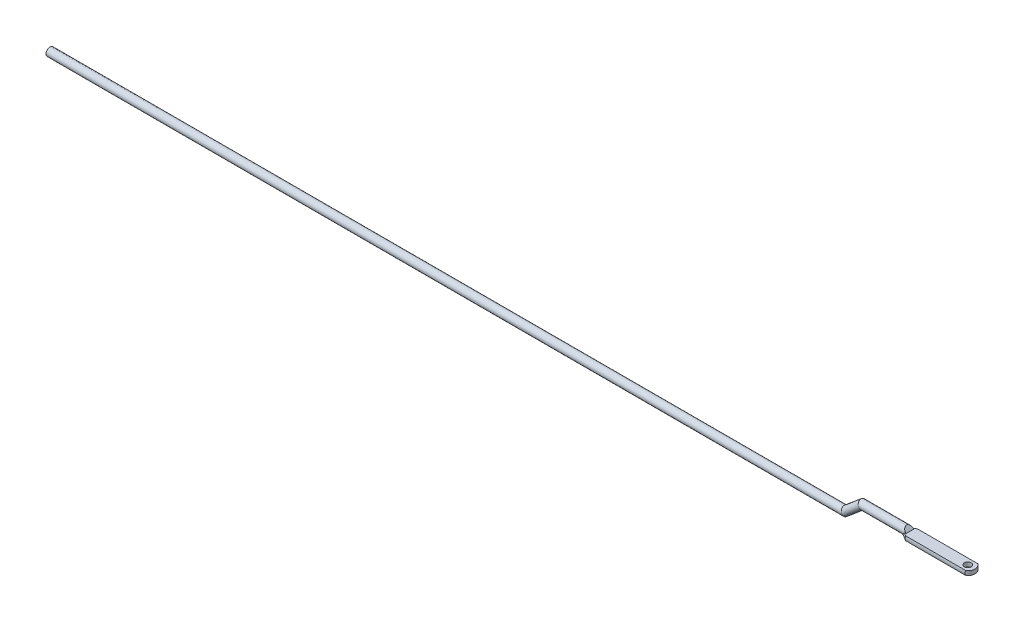
ISO-10303-21;
HEADER;
FILE_DESCRIPTION(('STEP AP214'),'2;1');
FILE_NAME('part.step','',(''),(''),'','','');
FILE_SCHEMA(('AUTOMOTIVE_DESIGN { 1 0 10303 214 1 1 1 1 }'));
ENDSEC;
DATA;
#1=APPLICATION_CONTEXT('core data for automotive mechanical design processes');
#2=APPLICATION_PROTOCOL_DEFINITION('international standard','automotive_design',2000,#1);
#3=PRODUCT_CONTEXT('',#1,'mechanical');
#4=PRODUCT('Part','Part','',(#3));
#5=PRODUCT_RELATED_PRODUCT_CATEGORY('part','',(#4));
#6=PRODUCT_DEFINITION_FORMATION('','',#4);
#7=PRODUCT_DEFINITION_CONTEXT('part definition',#1,'design');
#8=PRODUCT_DEFINITION('design','',#6,#7);
#9=PRODUCT_DEFINITION_SHAPE('','',#8);
#10=(LENGTH_UNIT() NAMED_UNIT(*) SI_UNIT(.MILLI.,.METRE.));
#11=(NAMED_UNIT(*) PLANE_ANGLE_UNIT() SI_UNIT($,.RADIAN.));
#12=(NAMED_UNIT(*) SI_UNIT($,.STERADIAN.) SOLID_ANGLE_UNIT());
#13=UNCERTAINTY_MEASURE_WITH_UNIT(LENGTH_MEASURE(1.E-05),#10,'distance_accuracy_value','');
#14=(GEOMETRIC_REPRESENTATION_CONTEXT(3) GLOBAL_UNCERTAINTY_ASSIGNED_CONTEXT((#13)) GLOBAL_UNIT_ASSIGNED_CONTEXT((#10,
#11,#12)) REPRESENTATION_CONTEXT('',''));
#15=CARTESIAN_POINT('',(0.,0.,0.));
#16=DIRECTION('',(0.,0.,1.));
#17=DIRECTION('',(1.,0.,0.));
#18=AXIS2_PLACEMENT_3D('',#15,#16,#17);
#19=CARTESIAN_POINT('',(956.096511051918,16.7819926235456,0.));
#20=DIRECTION('',(1.,0.,0.));
#21=DIRECTION('',(0.,0.,-1.));
#22=AXIS2_PLACEMENT_3D('',#19,#20,#21);
#23=CYLINDRICAL_SURFACE('',#22,4.75);
#24=CARTESIAN_POINT('',(960.,16.7819926235456,0.));
#25=DIRECTION('',(0.939692620785908,0.34202014332567,0.));
#26=DIRECTION('',(-0.34202014332567,0.939692620785908,0.));
#27=AXIS2_PLACEMENT_3D('',#24,#25,#26);
#28=ELLIPSE('',#27,5.05484441926058,4.75);
#29=CARTESIAN_POINT('',(958.271141387236,21.5319926235456,0.));
#30=VERTEX_POINT('',#29);
#31=EDGE_CURVE('E154',#30,#30,#28,.F.);
#32=ORIENTED_EDGE('',*,*,#31,.F.);
#33=EDGE_LOOP('',(#32));
#34=FACE_BOUND('',#33,.T.);
#35=CARTESIAN_POINT('',(1016.22222222222,16.7819926235456,0.));
#36=DIRECTION('',(0.747409318683656,0.664363838829924,0.));
#37=DIRECTION('',(0.664363838829924,-0.747409318683656,0.));
#38=AXIS2_PLACEMENT_3D('',#35,#36,#37);
#39=ELLIPSE('',#38,6.35528602769596,4.75);
#40=CARTESIAN_POINT('',(1016.,17.0319926235457,4.74341649025256));
#41=VERTEX_POINT('',#40);
#42=CARTESIAN_POINT('',(1016.,17.0319926235457,-4.74341649025256));
#43=VERTEX_POINT('',#42);
#44=EDGE_CURVE('E118',#41,#43,#39,.F.);
#45=ORIENTED_EDGE('',*,*,#44,.T.);
#46=DIRECTION('',(1.,0.,0.));
#47=VECTOR('',#46,1.);
#48=CARTESIAN_POINT('',(956.096511051918,17.0319926235457,-4.74341649025257));
#49=LINE('',#48,#47);
#50=CARTESIAN_POINT('',(1014.33469025265,17.0319926235457,-4.74341649025257));
#51=VERTEX_POINT('',#50);
#52=EDGE_CURVE('E122',#43,#51,#49,.F.);
#53=ORIENTED_EDGE('',*,*,#52,.T.);
#54=CARTESIAN_POINT('',(1014.33469025265,17.0319926235457,-4.74341649025257));
#55=CARTESIAN_POINT('',(1014.21305317343,16.8628774347375,-4.75232834899901));
#56=CARTESIAN_POINT('',(1014.08960938619,16.6946553979478,-4.75212888884802));
#57=CARTESIAN_POINT('',(1013.83979929456,16.3613804978993,-4.73428178527844));
#58=CARTESIAN_POINT('',(1013.71343361652,16.1963269690606,-4.71663784806983));
#59=CARTESIAN_POINT('',(1013.46088789269,15.8738522477424,-4.66518252377489));
#60=CARTESIAN_POINT('',(1013.33475165092,15.7163451477146,-4.63169087613737));
#61=CARTESIAN_POINT('',(1013.08092627956,15.4067532413373,-4.54938048577621));
#62=CARTESIAN_POINT('',(1012.95323751339,15.2546671975999,-4.50056526601985));
#63=CARTESIAN_POINT('',(1012.68878111105,14.9474238247766,-4.38469054741096));
#64=CARTESIAN_POINT('',(1012.55195072935,14.79268218778,-4.31667125212486));
#65=CARTESIAN_POINT('',(1012.27663482801,14.489867787797,-4.1638543346768));
#66=CARTESIAN_POINT('',(1012.13814704678,14.3418823665092,-4.0788876397377));
#67=CARTESIAN_POINT('',(1012.,14.1986592902122,-3.98608691436708));
#68=B_SPLINE_CURVE_WITH_KNOTS('',3,(#54,#55,#56,#57,#58,#59,#60,#61,#62,#63,#64,#65,#66,#67),
.UNSPECIFIED.,.F.,.F.,(4,2,2,2,2,2,4),(0.,0.62522616079936,1.25031951614986,1.86330644562614,
2.47615254937317,3.12781877921562,3.78634446563889),.UNSPECIFIED.);
#69=CARTESIAN_POINT('',(1012.,14.1986592902122,-3.98608691436709));
#70=VERTEX_POINT('',#69);
#71=EDGE_CURVE('E56',#51,#70,#68,.T.);
#72=ORIENTED_EDGE('',*,*,#71,.T.);
#73=CARTESIAN_POINT('',(1012.,16.7819926235456,0.));
#74=DIRECTION('',(-1.,0.,0.));
#75=DIRECTION('',(0.,0.,1.));
#76=AXIS2_PLACEMENT_3D('',#73,#74,#75);
#77=CIRCLE('',#76,4.75);
#78=CARTESIAN_POINT('',(1012.,12.0319926235456,0.));
#79=VERTEX_POINT('',#78);
#80=EDGE_CURVE('E135',#79,#70,#77,.F.);
#81=ORIENTED_EDGE('',*,*,#80,.F.);
#82=CARTESIAN_POINT('',(1012.,14.1986592902122,3.98608691436709));
#83=VERTEX_POINT('',#82);
#84=EDGE_CURVE('E132',#83,#79,#77,.F.);
#85=ORIENTED_EDGE('',*,*,#84,.F.);
#86=CARTESIAN_POINT('',(1012.,14.1986592902122,3.98608691436709));
#87=CARTESIAN_POINT('',(1012.14053551587,14.3443561885857,4.08048938310137));
#88=CARTESIAN_POINT('',(1012.28142105099,14.4949819204048,4.16678676095297));
#89=CARTESIAN_POINT('',(1012.56306779545,14.8050665449138,4.3225502698673));
#90=CARTESIAN_POINT('',(1012.70382880453,14.9645326654044,4.3920023714594));
#91=CARTESIAN_POINT('',(1012.98115351037,15.287519704682,4.51199197867805));
#92=CARTESIAN_POINT('',(1013.1177424013,15.4508798423739,4.56290388287247));
#93=CARTESIAN_POINT('',(1013.38893742938,15.7835270374267,4.64703990910272));
#94=CARTESIAN_POINT('',(1013.52354482552,15.9528100781711,4.68027577952509));
#95=CARTESIAN_POINT('',(1013.77157491801,16.2721758889885,4.72491751835714));
#96=CARTESIAN_POINT('',(1013.88534247085,16.4216583797686,4.7387148830513));
#97=CARTESIAN_POINT('',(1014.11148325595,16.7244949629758,4.75209216791378));
#98=CARTESIAN_POINT('',(1014.22383333409,16.8778722386854,4.75153724542536));
#99=CARTESIAN_POINT('',(1014.33469025265,17.0319926235458,4.74341649025256));
#100=B_SPLINE_CURVE_WITH_KNOTS('',3,(#86,#87,#88,#89,#90,#91,#92,#93,#94,#95,#96,#97,#98,#99),
.UNSPECIFIED.,.F.,.F.,(4,2,2,2,2,2,4),(0.,0.669896272150379,1.34034856158219,1.99639290383014,
2.65200065914661,3.21651661743064,3.78633822801414),.UNSPECIFIED.);
#101=CARTESIAN_POINT('',(1014.33469025265,17.0319926235457,4.74341649025257));
#102=VERTEX_POINT('',#101);
#103=EDGE_CURVE('E11',#83,#102,#100,.T.);
#104=ORIENTED_EDGE('',*,*,#103,.T.);
#105=DIRECTION('',(1.,0.,0.));
#106=VECTOR('',#105,1.);
#107=CARTESIAN_POINT('',(956.096511051918,17.0319926235457,4.74341649025257));
#108=LINE('',#107,#106);
#109=EDGE_CURVE('E115',#102,#41,#108,.T.);
#110=ORIENTED_EDGE('',*,*,#109,.T.);
#111=EDGE_LOOP('',(#45,#53,#72,#81,#85,#104,#110));
#112=FACE_BOUND('',#111,.T.);
#113=ADVANCED_FACE('F41',(#34,#112),#23,.T.);
#114=CARTESIAN_POINT('',(1093.,12.0319926235456,7.07106781186547));
#115=DIRECTION('',(0.,1.,0.));
#116=DIRECTION('',(0.,0.,1.));
#117=AXIS2_PLACEMENT_3D('',#114,#115,#116);
#118=PLANE('',#117);
#119=DIRECTION('',(0.,0.,1.));
#120=VECTOR('',#119,1.);
#121=CARTESIAN_POINT('',(1012.,12.0319926235456,-7.07106781186548));
#122=LINE('',#121,#120);
#123=CARTESIAN_POINT('',(1012.,12.0319926235456,-3.12249899919914));
#124=VERTEX_POINT('',#123);
#125=EDGE_CURVE('E123',#124,#79,#122,.T.);
#126=ORIENTED_EDGE('',*,*,#125,.F.);
#127=CARTESIAN_POINT('',(1012.,12.0319926235456,-3.12249899919914));
#128=CARTESIAN_POINT('',(1012.08896499616,12.0319926235456,-3.18897224610189));
#129=CARTESIAN_POINT('',(1012.17831854787,12.0319926235456,-3.25492168128244));
#130=CARTESIAN_POINT('',(1012.35769284356,12.0319926235456,-3.38590188112761));
#131=CARTESIAN_POINT('',(1012.44771356813,12.0319926235456,-3.45093267234628));
#132=CARTESIAN_POINT('',(1012.71859882597,12.0319926235456,-3.64483149535156));
#133=CARTESIAN_POINT('',(1012.90030676236,12.0319926235456,-3.77252106233519));
#134=CARTESIAN_POINT('',(1013.26533289098,12.0319926235456,-4.02546187450804));
#135=CARTESIAN_POINT('',(1013.44865063294,12.0319926235456,-4.15071377186225));
#136=CARTESIAN_POINT('',(1013.81656712725,12.0319926235456,-4.39933227052687));
#137=CARTESIAN_POINT('',(1014.00116592202,12.0319926235456,-4.52269880896613));
#138=CARTESIAN_POINT('',(1014.55628062489,12.0319926235456,-4.89044675267985));
#139=CARTESIAN_POINT('',(1014.92827875858,12.0319926235456,-5.13258891828468));
#140=CARTESIAN_POINT('',(1015.67484865689,12.0319926235456,-5.61290966649172));
#141=CARTESIAN_POINT('',(1016.04942059082,12.0319926235456,-5.85108798474813));
#142=CARTESIAN_POINT('',(1016.55575873653,12.0319926235456,-6.17038258647223));
#143=CARTESIAN_POINT('',(1016.68674335077,12.0319926235456,-6.25274094632335));
#144=CARTESIAN_POINT('',(1016.94890395649,12.0319926235456,-6.41714604385921));
#145=CARTESIAN_POINT('',(1017.08007994358,12.0319926235456,-6.49919278853354));
#146=CARTESIAN_POINT('',(1017.34262249117,12.0319926235456,-6.66302050063738));
#147=CARTESIAN_POINT('',(1017.47398907514,12.0319926235456,-6.74480143041838));
#148=CARTESIAN_POINT('',(1017.73688072432,12.0319926235456,-6.90811479549825));
#149=CARTESIAN_POINT('',(1017.86840579303,12.0319926235456,-6.98964722516326));
#150=CARTESIAN_POINT('',(1018.,12.0319926235456,-7.07106781186542));
#151=B_SPLINE_CURVE_WITH_KNOTS('',3,(#127,#128,#129,#130,#131,#132,#133,#134,#135,#136,#137,
#138,#139,#140,#141,#142,#143,#144,#145,#146,#147,#148,#149,#150),.UNSPECIFIED.,.F.,.F.,(4,2,2,
2,2,2,2,2,2,2,2,4),(0.,0.333163013981663,0.666316377862597,1.3325471965924,1.99859725376556,
2.66466947348958,3.99621770953673,5.32785439247537,5.79202955208276,6.25619423793916,
6.72042202646316,7.18466026257332),.UNSPECIFIED.);
#152=CARTESIAN_POINT('',(1018.,12.0319926235456,-7.07106781186548));
#153=VERTEX_POINT('',#152);
#154=EDGE_CURVE('E169',#124,#153,#151,.T.);
#155=ORIENTED_EDGE('',*,*,#154,.T.);
#156=DIRECTION('',(-1.,0.,0.));
#157=VECTOR('',#156,1.);
#158=CARTESIAN_POINT('',(1093.,12.0319926235456,-7.07106781186548));
#159=LINE('',#158,#157);
#160=CARTESIAN_POINT('',(1089.23689300594,12.0319926235456,-7.07106781186548));
#161=VERTEX_POINT('',#160);
#162=EDGE_CURVE('E148',#161,#153,#159,.T.);
#163=ORIENTED_EDGE('',*,*,#162,.F.);
#164=CARTESIAN_POINT('',(1084.475,12.0319926235456,0.));
#165=DIRECTION('',(0.,1.,0.));
#166=DIRECTION('',(0.,0.,1.));
#167=AXIS2_PLACEMENT_3D('',#164,#165,#166);
#168=CIRCLE('',#167,8.52499999999992);
#169=CARTESIAN_POINT('',(1089.23689300594,12.0319926235456,7.07106781186547));
#170=VERTEX_POINT('',#169);
#171=EDGE_CURVE('E203',#161,#170,#168,.F.);
#172=ORIENTED_EDGE('',*,*,#171,.T.);
#173=DIRECTION('',(-1.,0.,0.));
#174=VECTOR('',#173,1.);
#175=CARTESIAN_POINT('',(1093.,12.0319926235456,7.07106781186547));
#176=LINE('',#175,#174);
#177=CARTESIAN_POINT('',(1018.,12.0319926235456,7.07106781186547));
#178=VERTEX_POINT('',#177);
#179=EDGE_CURVE('E151',#170,#178,#176,.T.);
#180=ORIENTED_EDGE('',*,*,#179,.T.);
#181=CARTESIAN_POINT('',(1018.,12.0319926235456,7.07106781186547));
#182=CARTESIAN_POINT('',(1017.74543359375,12.0319926235456,6.91354786001381));
#183=CARTESIAN_POINT('',(1017.49111501313,12.0319926235456,6.75562515674965));
#184=CARTESIAN_POINT('',(1016.98312693062,12.0319926235456,6.43874407655408));
#185=CARTESIAN_POINT('',(1016.72945742359,12.0319926235456,6.27978570787384));
#186=CARTESIAN_POINT('',(1016.22301082109,12.0319926235456,5.96065983423393));
#187=CARTESIAN_POINT('',(1015.97023342947,12.0319926235456,5.80049279973389));
#188=CARTESIAN_POINT('',(1015.46569251714,12.0319926235456,5.47855648910929));
#189=CARTESIAN_POINT('',(1015.21392901711,12.0319926235456,5.31678718054436));
#190=CARTESIAN_POINT('',(1014.71164558145,12.0319926235456,4.99113909233601));
#191=CARTESIAN_POINT('',(1014.46112610307,12.0319926235456,4.82725960664713));
#192=CARTESIAN_POINT('',(1013.96188151105,12.0319926235456,4.49680910663263));
#193=CARTESIAN_POINT('',(1013.71315630199,12.0319926235456,4.33023823697934));
#194=CARTESIAN_POINT('',(1013.34189389428,12.0319926235456,4.07759358188701));
#195=CARTESIAN_POINT('',(1013.21841966044,12.0319926235456,3.99289687972642));
#196=CARTESIAN_POINT('',(1012.97222988513,12.0319926235456,3.82241097814521));
#197=CARTESIAN_POINT('',(1012.84951433163,12.0319926235456,3.73662179612027));
#198=CARTESIAN_POINT('',(1012.60497740952,12.0319926235456,3.56372953951362));
#199=CARTESIAN_POINT('',(1012.48315620373,12.0319926235456,3.47662623408908));
#200=CARTESIAN_POINT('',(1012.24065875924,12.0319926235456,3.30082761004039));
#201=CARTESIAN_POINT('',(1012.11998258383,12.0319926235456,3.21213220418898));
#202=CARTESIAN_POINT('',(1012.,12.0319926235456,3.12249899919913));
#203=B_SPLINE_CURVE_WITH_KNOTS('',3,(#181,#182,#183,#184,#185,#186,#187,#188,#189,#190,#191,
#192,#193,#194,#195,#196,#197,#198,#199,#200,#201,#202),.UNSPECIFIED.,.F.,.F.,(4,2,2,2,2,2,2,2,
2,2,4),(0.,0.898082308913276,1.79615747150041,2.6938994543704,3.59165965064053,4.48972846549864,
5.38774916522751,5.83693790735778,6.28611950592884,6.73538094965656,7.18466708290069),.UNSPECIFIED.);
#204=CARTESIAN_POINT('',(1012.,12.0319926235456,3.12249899919914));
#205=VERTEX_POINT('',#204);
#206=EDGE_CURVE('E162',#178,#205,#203,.T.);
#207=ORIENTED_EDGE('',*,*,#206,.T.);
#208=EDGE_CURVE('E394',#79,#205,#122,.T.);
#209=ORIENTED_EDGE('',*,*,#208,.F.);
#210=EDGE_LOOP('',(#126,#155,#163,#172,#180,#207,#209));
#211=FACE_BOUND('',#210,.T.);
#212=CARTESIAN_POINT('',(1084.475,12.0319926235456,0.));
#213=DIRECTION('',(0.,1.,0.));
#214=DIRECTION('',(0.,0.,1.));
#215=AXIS2_PLACEMENT_3D('',#212,#213,#214);
#216=CIRCLE('',#215,4.12499999999999);
#217=CARTESIAN_POINT('',(1084.475,12.0319926235456,4.12499999999999));
#218=VERTEX_POINT('',#217);
#219=EDGE_CURVE('E142',#218,#218,#216,.T.);
#220=ORIENTED_EDGE('',*,*,#219,.T.);
#221=EDGE_LOOP('',(#220));
#222=FACE_BOUND('',#221,.T.);
#223=ADVANCED_FACE('F175',(#211,#222),#118,.F.);
#224=CARTESIAN_POINT('',(1093.,17.0319926235457,7.07106781186547));
#225=DIRECTION('',(0.,1.,0.));
#226=DIRECTION('',(0.,0.,1.));
#227=AXIS2_PLACEMENT_3D('',#224,#225,#226);
#228=PLANE('',#227);
#229=CARTESIAN_POINT('',(1084.475,17.0319926235457,0.));
#230=DIRECTION('',(0.,1.,0.));
#231=DIRECTION('',(0.,0.,1.));
#232=AXIS2_PLACEMENT_3D('',#229,#230,#231);
#233=CIRCLE('',#232,4.12499999999999);
#234=CARTESIAN_POINT('',(1084.475,17.0319926235457,4.12499999999999));
#235=VERTEX_POINT('',#234);
#236=EDGE_CURVE('E412',#235,#235,#233,.T.);
#237=ORIENTED_EDGE('',*,*,#236,.F.);
#238=EDGE_LOOP('',(#237));
#239=FACE_BOUND('',#238,.T.);
#240=DIRECTION('',(-1.,0.,0.));
#241=VECTOR('',#240,1.);
#242=CARTESIAN_POINT('',(1093.,17.0319926235457,-7.07106781186548));
#243=LINE('',#242,#241);
#244=CARTESIAN_POINT('',(1089.23689300594,17.0319926235457,-7.07106781186551));
#245=VERTEX_POINT('',#244);
#246=CARTESIAN_POINT('',(1018.,17.0319926235457,-7.07106781186548));
#247=VERTEX_POINT('',#246);
#248=EDGE_CURVE('E146',#245,#247,#243,.T.);
#249=ORIENTED_EDGE('',*,*,#248,.T.);
#250=CARTESIAN_POINT('',(1018.,17.0319926235457,-7.07106781186548));
#251=CARTESIAN_POINT('',(1017.69230688719,17.0319926235457,-6.88065876700496));
#252=CARTESIAN_POINT('',(1017.38496531289,17.0319926235457,-6.68967709118113));
#253=CARTESIAN_POINT('',(1016.77128888269,17.0319926235457,-6.3061371660752));
#254=CARTESIAN_POINT('',(1016.46495397834,17.0319926235457,-6.11357899426665));
#255=CARTESIAN_POINT('',(1015.85355740023,17.0319926235457,-5.72643180918901));
#256=CARTESIAN_POINT('',(1015.54849575582,17.0319926235457,-5.53184274944877));
#257=CARTESIAN_POINT('',(1015.09221222356,17.0319926235457,-5.23791062603528));
#258=CARTESIAN_POINT('',(1014.9403321677,17.0319926235457,-5.13958939805002));
#259=CARTESIAN_POINT('',(1014.63709617806,17.0319926235457,-4.94213958499345));
#260=CARTESIAN_POINT('',(1014.48574024852,17.0319926235457,-4.84301099340926));
#261=CARTESIAN_POINT('',(1014.33469025265,17.0319926235457,-4.7434164902526));
#262=B_SPLINE_CURVE_WITH_KNOTS('',3,(#250,#251,#252,#253,#254,#255,#256,#257,#258,#259,#260,
#261),.UNSPECIFIED.,.F.,.F.,(4,2,2,2,2,4),(0.,1.08553305111921,2.17101307246019,
3.25651798664801,3.79929701047647,4.3420804171632),.UNSPECIFIED.);
#263=EDGE_CURVE('E230',#247,#51,#262,.T.);
#264=ORIENTED_EDGE('',*,*,#263,.T.);
#265=ORIENTED_EDGE('',*,*,#52,.F.);
#266=DIRECTION('',(0.,0.,-1.));
#267=VECTOR('',#266,1.);
#268=CARTESIAN_POINT('',(1016.,17.0319926235457,7.07106781186547));
#269=LINE('',#268,#267);
#270=EDGE_CURVE('E127',#41,#43,#269,.T.);
#271=ORIENTED_EDGE('',*,*,#270,.F.);
#272=ORIENTED_EDGE('',*,*,#109,.F.);
#273=CARTESIAN_POINT('',(1014.33469025265,17.0319926235457,4.74341649025257));
#274=CARTESIAN_POINT('',(1014.48574024852,17.0319926235457,4.84301099340915));
#275=CARTESIAN_POINT('',(1014.63709617806,17.0319926235457,4.94213958499333));
#276=CARTESIAN_POINT('',(1014.9403321677,17.0319926235457,5.13958939804994));
#277=CARTESIAN_POINT('',(1015.09221222356,17.0319926235457,5.23791062603525));
#278=CARTESIAN_POINT('',(1015.54849575582,17.0319926235457,5.53184274944881));
#279=CARTESIAN_POINT('',(1015.85355740023,17.0319926235457,5.72643180918902));
#280=CARTESIAN_POINT('',(1016.46495397834,17.0319926235457,6.11357899426663));
#281=CARTESIAN_POINT('',(1016.77128888269,17.0319926235457,6.30613716607519));
#282=CARTESIAN_POINT('',(1017.38496531289,17.0319926235457,6.68967709118112));
#283=CARTESIAN_POINT('',(1017.69230688719,17.0319926235457,6.88065876700495));
#284=CARTESIAN_POINT('',(1018.,17.0319926235457,7.07106781186541));
#285=B_SPLINE_CURVE_WITH_KNOTS('',3,(#273,#274,#275,#276,#277,#278,#279,#280,#281,#282,#283,
#284),.UNSPECIFIED.,.F.,.F.,(4,2,2,2,2,4),(0.,0.542783406686689,1.08556243051521,
2.17106734470302,3.256547366044,4.34208041716319),.UNSPECIFIED.);
#286=CARTESIAN_POINT('',(1018.,17.0319926235457,7.07106781186547));
#287=VERTEX_POINT('',#286);
#288=EDGE_CURVE('E68',#102,#287,#285,.T.);
#289=ORIENTED_EDGE('',*,*,#288,.T.);
#290=DIRECTION('',(-1.,0.,0.));
#291=VECTOR('',#290,1.);
#292=CARTESIAN_POINT('',(1093.,17.0319926235457,7.07106781186547));
#293=LINE('',#292,#291);
#294=CARTESIAN_POINT('',(1089.23689300594,17.0319926235457,7.07106781186551));
#295=VERTEX_POINT('',#294);
#296=EDGE_CURVE('E144',#295,#287,#293,.T.);
#297=ORIENTED_EDGE('',*,*,#296,.F.);
#298=CARTESIAN_POINT('',(1084.475,17.0319926235457,0.));
#299=DIRECTION('',(0.,-1.,0.));
#300=DIRECTION('',(0.,0.,1.));
#301=AXIS2_PLACEMENT_3D('',#298,#299,#300);
#302=CIRCLE('',#301,8.52499999999992);
#303=EDGE_CURVE('E128',#245,#295,#302,.T.);
#304=ORIENTED_EDGE('',*,*,#303,.F.);
#305=EDGE_LOOP('',(#249,#264,#265,#271,#272,#289,#297,#304));
#306=FACE_BOUND('',#305,.T.);
#307=ADVANCED_FACE('F131',(#239,#306),#228,.T.);
#308=CARTESIAN_POINT('',(0.,0.,0.));
#309=DIRECTION('',(1.,0.,0.));
#310=DIRECTION('',(0.,0.,-1.));
#311=AXIS2_PLACEMENT_3D('',#308,#309,#310);
#312=PLANE('',#311);
#313=CARTESIAN_POINT('',(0.,0.,0.));
#314=DIRECTION('',(1.,0.,0.));
#315=DIRECTION('',(0.,0.,-1.));
#316=AXIS2_PLACEMENT_3D('',#313,#314,#315);
#317=CIRCLE('',#316,4.75);
#318=CARTESIAN_POINT('',(0.,0.,-4.75));
#319=VERTEX_POINT('',#318);
#320=EDGE_CURVE('E138',#319,#319,#317,.T.);
#321=ORIENTED_EDGE('',*,*,#320,.F.);
#322=EDGE_LOOP('',(#321));
#323=FACE_BOUND('',#322,.T.);
#324=ADVANCED_FACE('F191',(#323),#312,.F.);
#325=CARTESIAN_POINT('',(937.009753982546,-2.50911433037545,0.));
#326=DIRECTION('',(0.766044443118977,0.642787609686541,0.));
#327=DIRECTION('',(-0.642787609686541,0.766044443118977,0.));
#328=AXIS2_PLACEMENT_3D('',#325,#326,#327);
#329=CYLINDRICAL_SURFACE('',#328,4.75);
#330=CARTESIAN_POINT('',(940.,0.,0.));
#331=DIRECTION('',(0.939692620785908,0.34202014332567,0.));
#332=DIRECTION('',(0.34202014332567,-0.939692620785908,0.));
#333=AXIS2_PLACEMENT_3D('',#330,#331,#332);
#334=ELLIPSE('',#333,5.05484441926058,4.75);
#335=CARTESIAN_POINT('',(941.728858612764,-4.75,0.));
#336=VERTEX_POINT('',#335);
#337=EDGE_CURVE('E133',#336,#336,#334,.F.);
#338=ORIENTED_EDGE('',*,*,#337,.F.);
#339=EDGE_LOOP('',(#338));
#340=FACE_BOUND('',#339,.T.);
#341=ORIENTED_EDGE('',*,*,#31,.T.);
#342=EDGE_LOOP('',(#341));
#343=FACE_BOUND('',#342,.T.);
#344=ADVANCED_FACE('F257',(#340,#343),#329,.T.);
#345=CARTESIAN_POINT('',(0.,0.,0.));
#346=DIRECTION('',(1.,0.,0.));
#347=DIRECTION('',(0.,0.,-1.));
#348=AXIS2_PLACEMENT_3D('',#345,#346,#347);
#349=CYLINDRICAL_SURFACE('',#348,4.75);
#350=ORIENTED_EDGE('',*,*,#320,.T.);
#351=EDGE_LOOP('',(#350));
#352=FACE_BOUND('',#351,.T.);
#353=ORIENTED_EDGE('',*,*,#337,.T.);
#354=EDGE_LOOP('',(#353));
#355=FACE_BOUND('',#354,.T.);
#356=ADVANCED_FACE('F189',(#352,#355),#349,.T.);
#357=CARTESIAN_POINT('',(1093.,14.5319926235456,0.));
#358=DIRECTION('',(-1.,0.,0.));
#359=DIRECTION('',(0.,0.,1.));
#360=AXIS2_PLACEMENT_3D('',#357,#358,#359);
#361=CYLINDRICAL_SURFACE('',#360,7.50000000000001);
#362=ORIENTED_EDGE('',*,*,#296,.T.);
#363=CARTESIAN_POINT('',(1018.,14.5319926235456,0.));
#364=DIRECTION('',(-1.,0.,0.));
#365=DIRECTION('',(0.,0.,1.));
#366=AXIS2_PLACEMENT_3D('',#363,#364,#365);
#367=CIRCLE('',#366,7.50000000000001);
#368=EDGE_CURVE('E253',#287,#178,#367,.F.);
#369=ORIENTED_EDGE('',*,*,#368,.T.);
#370=ORIENTED_EDGE('',*,*,#179,.F.);
#371=CARTESIAN_POINT('',(1089.23689300594,12.0319926235456,7.07106781186547));
#372=CARTESIAN_POINT('',(1089.181466679,12.1376314519707,7.10840216265812));
#373=CARTESIAN_POINT('',(1089.12769051861,12.2448491229847,7.14365942587136));
#374=CARTESIAN_POINT('',(1089.0244453465,12.4628986647781,7.20984869891785));
#375=CARTESIAN_POINT('',(1088.97498470546,12.5737370104742,7.24077237045317));
#376=CARTESIAN_POINT('',(1088.83372857703,12.9145908918637,7.32730239048002));
#377=CARTESIAN_POINT('',(1088.75051216385,13.1502994134118,7.37571424970978));
#378=CARTESIAN_POINT('',(1088.62994183539,13.5960261530768,7.44420632567847));
#379=CARTESIAN_POINT('',(1088.587362775,13.804075088798,7.46759194073111));
#380=CARTESIAN_POINT('',(1088.53424943391,14.2241728778598,7.49660709052912));
#381=CARTESIAN_POINT('',(1088.52348549543,14.4361818919251,7.50236388999994));
#382=CARTESIAN_POINT('',(1088.53552160589,14.8590960950471,7.49585279667887));
#383=CARTESIAN_POINT('',(1088.55835286382,15.070000074841,7.483568143902));
#384=CARTESIAN_POINT('',(1088.63352567816,15.4859863343351,7.44204530022931));
#385=CARTESIAN_POINT('',(1088.68607399559,15.691017134332,7.41268828473878));
#386=CARTESIAN_POINT('',(1088.8137377891,16.092671462436,7.33869191171193));
#387=CARTESIAN_POINT('',(1088.88903436482,16.2892124910592,7.29392949776938));
#388=CARTESIAN_POINT('',(1089.01283636851,16.5749224609646,7.21706336543756));
#389=CARTESIAN_POINT('',(1089.05560734265,16.6680776065319,7.19002315656449));
#390=CARTESIAN_POINT('',(1089.14415356599,16.8518673479088,7.13284049351209));
#391=CARTESIAN_POINT('',(1089.18992600241,16.9425041934029,7.10270092920253));
#392=CARTESIAN_POINT('',(1089.23689300594,17.0319926235457,7.07106781186546));
#393=B_SPLINE_CURVE_WITH_KNOTS('',3,(#371,#372,#373,#374,#375,#376,#377,#378,#379,#380,#381,
#382,#383,#384,#385,#386,#387,#388,#389,#390,#391,#392),.UNSPECIFIED.,.F.,.F.,(4,2,2,2,2,2,2,2,
2,2,4),(0.,0.374903874609865,0.750519481235278,1.51119008737964,2.14945910201274,
2.78310937514919,3.41734866345036,4.05605604019668,4.69998852642047,5.0179330099531,
5.33558368163216),.UNSPECIFIED.);
#394=EDGE_CURVE('E194',#170,#295,#393,.T.);
#395=ORIENTED_EDGE('',*,*,#394,.T.);
#396=EDGE_LOOP('',(#362,#369,#370,#395));
#397=FACE_BOUND('',#396,.T.);
#398=ADVANCED_FACE('F184',(#397),#361,.T.);
#399=CARTESIAN_POINT('',(1093.,14.5319926235456,0.));
#400=DIRECTION('',(-1.,0.,0.));
#401=DIRECTION('',(0.,0.,1.));
#402=AXIS2_PLACEMENT_3D('',#399,#400,#401);
#403=CYLINDRICAL_SURFACE('',#402,7.50000000000001);
#404=ORIENTED_EDGE('',*,*,#162,.T.);
#405=CARTESIAN_POINT('',(1018.,14.5319926235456,0.));
#406=DIRECTION('',(-1.,0.,0.));
#407=DIRECTION('',(0.,0.,1.));
#408=AXIS2_PLACEMENT_3D('',#405,#406,#407);
#409=CIRCLE('',#408,7.50000000000001);
#410=EDGE_CURVE('E408',#153,#247,#409,.F.);
#411=ORIENTED_EDGE('',*,*,#410,.T.);
#412=ORIENTED_EDGE('',*,*,#248,.F.);
#413=CARTESIAN_POINT('',(1089.23689300594,17.0319926235457,-7.07106781186547));
#414=CARTESIAN_POINT('',(1089.181466679,16.9263537951206,-7.10840216265812));
#415=CARTESIAN_POINT('',(1089.12769051861,16.8191361241066,-7.14365942587136));
#416=CARTESIAN_POINT('',(1089.0244453465,16.6010865823132,-7.20984869891784));
#417=CARTESIAN_POINT('',(1088.97498470546,16.4902482366171,-7.24077237045316));
#418=CARTESIAN_POINT('',(1088.83372857703,16.1493943552276,-7.32730239048001));
#419=CARTESIAN_POINT('',(1088.75051216385,15.9136858336796,-7.37571424970978));
#420=CARTESIAN_POINT('',(1088.62994183539,15.4679590940145,-7.44420632567848));
#421=CARTESIAN_POINT('',(1088.587362775,15.2599101582932,-7.46759194073112));
#422=CARTESIAN_POINT('',(1088.53424943391,14.8398123692315,-7.49660709052913));
#423=CARTESIAN_POINT('',(1088.52348549543,14.6278033551662,-7.50236388999994));
#424=CARTESIAN_POINT('',(1088.53552160589,14.2048891520442,-7.49585279667887));
#425=CARTESIAN_POINT('',(1088.55835286382,13.9939851722502,-7.483568143902));
#426=CARTESIAN_POINT('',(1088.63352567816,13.5779989127562,-7.44204530022931));
#427=CARTESIAN_POINT('',(1088.68607399559,13.3729681127593,-7.41268828473878));
#428=CARTESIAN_POINT('',(1088.8137377891,12.9713137846553,-7.33869191171193));
#429=CARTESIAN_POINT('',(1088.88903436482,12.7747727560321,-7.29392949776939));
#430=CARTESIAN_POINT('',(1089.01283636851,12.4890627861266,-7.21706336543756));
#431=CARTESIAN_POINT('',(1089.05560734265,12.3959076405594,-7.19002315656449));
#432=CARTESIAN_POINT('',(1089.14415356599,12.2121178991825,-7.13284049351209));
#433=CARTESIAN_POINT('',(1089.18992600241,12.1214810536884,-7.10270092920253));
#434=CARTESIAN_POINT('',(1089.23689300594,12.0319926235456,-7.07106781186546));
#435=B_SPLINE_CURVE_WITH_KNOTS('',3,(#413,#414,#415,#416,#417,#418,#419,#420,#421,#422,#423,
#424,#425,#426,#427,#428,#429,#430,#431,#432,#433,#434),.UNSPECIFIED.,.F.,.F.,(4,2,2,2,2,2,2,2,
2,2,4),(0.,0.374903874609833,0.750519481235215,1.51119008737964,2.14945910201276,
2.78310937514919,3.41734866345036,4.05605604019668,4.69998852642048,5.01793300995311,
5.33558368163217),.UNSPECIFIED.);
#436=EDGE_CURVE('E202',#245,#161,#435,.T.);
#437=ORIENTED_EDGE('',*,*,#436,.T.);
#438=EDGE_LOOP('',(#404,#411,#412,#437));
#439=FACE_BOUND('',#438,.T.);
#440=ADVANCED_FACE('F181',(#439),#403,.T.);
#441=CARTESIAN_POINT('',(1084.475,-59.9680073764543,0.));
#442=DIRECTION('',(0.,1.,0.));
#443=DIRECTION('',(0.,0.,1.));
#444=AXIS2_PLACEMENT_3D('',#441,#442,#443);
#445=CYLINDRICAL_SURFACE('',#444,4.12499999999999);
#446=ORIENTED_EDGE('',*,*,#236,.T.);
#447=EDGE_LOOP('',(#446));
#448=FACE_BOUND('',#447,.T.);
#449=ORIENTED_EDGE('',*,*,#219,.F.);
#450=EDGE_LOOP('',(#449));
#451=FACE_BOUND('',#450,.T.);
#452=ADVANCED_FACE('F214',(#448,#451),#445,.F.);
#453=CARTESIAN_POINT('',(1084.475,-59.9680073764543,0.));
#454=DIRECTION('',(0.,1.,0.));
#455=DIRECTION('',(0.,0.,1.));
#456=AXIS2_PLACEMENT_3D('',#453,#454,#455);
#457=CYLINDRICAL_SURFACE('',#456,8.52499999999992);
#458=ORIENTED_EDGE('',*,*,#436,.F.);
#459=ORIENTED_EDGE('',*,*,#303,.T.);
#460=ORIENTED_EDGE('',*,*,#394,.F.);
#461=ORIENTED_EDGE('',*,*,#171,.F.);
#462=EDGE_LOOP('',(#458,#459,#460,#461));
#463=FACE_BOUND('',#462,.T.);
#464=ADVANCED_FACE('F209',(#463),#457,.T.);
#465=CARTESIAN_POINT('',(1016.,17.0319926235457,77.));
#466=DIRECTION('',(0.747409318683656,0.664363838829924,0.));
#467=DIRECTION('',(-0.664363838829924,0.747409318683656,0.));
#468=AXIS2_PLACEMENT_3D('',#465,#466,#467);
#469=PLANE('',#468);
#470=ORIENTED_EDGE('',*,*,#270,.T.);
#471=ORIENTED_EDGE('',*,*,#44,.F.);
#472=EDGE_LOOP('',(#470,#471));
#473=FACE_BOUND('',#472,.T.);
#474=ADVANCED_FACE('F126',(#473),#469,.T.);
#475=CARTESIAN_POINT('',(1012.,14.5319926235456,0.));
#476=DIRECTION('',(-1.,0.,0.));
#477=DIRECTION('',(0.,0.,1.));
#478=AXIS2_PLACEMENT_3D('',#475,#476,#477);
#479=PLANE('',#478);
#480=ORIENTED_EDGE('',*,*,#80,.T.);
#481=CARTESIAN_POINT('',(1012.,14.5319926235456,0.));
#482=DIRECTION('',(-1.,0.,0.));
#483=DIRECTION('',(0.,0.,1.));
#484=AXIS2_PLACEMENT_3D('',#481,#482,#483);
#485=CIRCLE('',#484,3.99999999999996);
#486=EDGE_CURVE('E159',#70,#124,#485,.T.);
#487=ORIENTED_EDGE('',*,*,#486,.T.);
#488=ORIENTED_EDGE('',*,*,#125,.T.);
#489=EDGE_LOOP('',(#480,#487,#488));
#490=FACE_BOUND('',#489,.T.);
#491=ADVANCED_FACE('F344',(#490),#479,.T.);
#492=ORIENTED_EDGE('',*,*,#208,.T.);
#493=CARTESIAN_POINT('',(1012.,14.5319926235456,0.));
#494=DIRECTION('',(-1.,0.,0.));
#495=DIRECTION('',(0.,0.,1.));
#496=AXIS2_PLACEMENT_3D('',#493,#494,#495);
#497=CIRCLE('',#496,3.99999999999997);
#498=EDGE_CURVE('E236',#205,#83,#497,.T.);
#499=ORIENTED_EDGE('',*,*,#498,.T.);
#500=ORIENTED_EDGE('',*,*,#84,.T.);
#501=EDGE_LOOP('',(#492,#499,#500));
#502=FACE_BOUND('',#501,.T.);
#503=ADVANCED_FACE('F245',(#502),#479,.T.);
#504=CARTESIAN_POINT('',(1012.,14.5319926235456,0.));
#505=DIRECTION('',(1.,0.,0.));
#506=DIRECTION('',(0.,0.,-1.));
#507=AXIS2_PLACEMENT_3D('',#504,#505,#506);
#508=CONICAL_SURFACE('',#507,3.99999999999996,0.528074448426365);
#509=ORIENTED_EDGE('',*,*,#263,.F.);
#510=ORIENTED_EDGE('',*,*,#410,.F.);
#511=ORIENTED_EDGE('',*,*,#154,.F.);
#512=ORIENTED_EDGE('',*,*,#486,.F.);
#513=ORIENTED_EDGE('',*,*,#71,.F.);
#514=EDGE_LOOP('',(#509,#510,#511,#512,#513));
#515=FACE_BOUND('',#514,.T.);
#516=ADVANCED_FACE('F239',(#515),#508,.T.);
#517=CARTESIAN_POINT('',(1012.,14.5319926235456,0.));
#518=DIRECTION('',(1.,0.,0.));
#519=DIRECTION('',(0.,0.,-1.));
#520=AXIS2_PLACEMENT_3D('',#517,#518,#519);
#521=CONICAL_SURFACE('',#520,3.99999999999997,0.528074448426365);
#522=ORIENTED_EDGE('',*,*,#206,.F.);
#523=ORIENTED_EDGE('',*,*,#368,.F.);
#524=ORIENTED_EDGE('',*,*,#288,.F.);
#525=ORIENTED_EDGE('',*,*,#103,.F.);
#526=ORIENTED_EDGE('',*,*,#498,.F.);
#527=EDGE_LOOP('',(#522,#523,#524,#525,#526));
#528=FACE_BOUND('',#527,.T.);
#529=ADVANCED_FACE('F44',(#528),#521,.T.);
#530=CLOSED_SHELL('',(#113,#223,#307,#324,#344,#356,#398,#440,#452,#464,#474,#491,#503,#516,#529));
#531=MANIFOLD_SOLID_BREP('B2',#530);
#532=ADVANCED_BREP_SHAPE_REPRESENTATION('',(#18,#531),#14);
#533=SHAPE_DEFINITION_REPRESENTATION(#9,#532);
ENDSEC;
END-ISO-10303-21;
